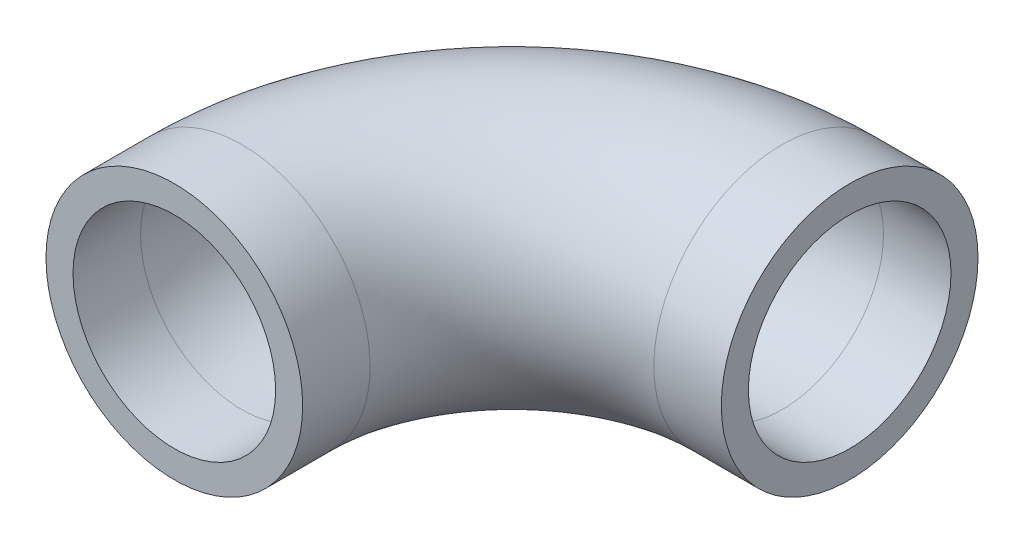
ISO-10303-21;
HEADER;
FILE_DESCRIPTION(('STEP AP214'),'2;1');
FILE_NAME('part.step','',(''),(''),'','','');
FILE_SCHEMA(('AUTOMOTIVE_DESIGN { 1 0 10303 214 1 1 1 1 }'));
ENDSEC;
DATA;
#1=APPLICATION_CONTEXT('core data for automotive mechanical design processes');
#2=APPLICATION_PROTOCOL_DEFINITION('international standard','automotive_design',2000,#1);
#3=PRODUCT_CONTEXT('',#1,'mechanical');
#4=PRODUCT('Part','Part','',(#3));
#5=PRODUCT_RELATED_PRODUCT_CATEGORY('part','',(#4));
#6=PRODUCT_DEFINITION_FORMATION('','',#4);
#7=PRODUCT_DEFINITION_CONTEXT('part definition',#1,'design');
#8=PRODUCT_DEFINITION('design','',#6,#7);
#9=PRODUCT_DEFINITION_SHAPE('','',#8);
#10=(LENGTH_UNIT() NAMED_UNIT(*) SI_UNIT(.MILLI.,.METRE.));
#11=(NAMED_UNIT(*) PLANE_ANGLE_UNIT() SI_UNIT($,.RADIAN.));
#12=(NAMED_UNIT(*) SI_UNIT($,.STERADIAN.) SOLID_ANGLE_UNIT());
#13=UNCERTAINTY_MEASURE_WITH_UNIT(LENGTH_MEASURE(1.E-05),#10,'distance_accuracy_value','');
#14=(GEOMETRIC_REPRESENTATION_CONTEXT(3) GLOBAL_UNCERTAINTY_ASSIGNED_CONTEXT((#13)) GLOBAL_UNIT_ASSIGNED_CONTEXT((#10,
#11,#12)) REPRESENTATION_CONTEXT('',''));
#15=CARTESIAN_POINT('',(0.,0.,0.));
#16=DIRECTION('',(0.,0.,1.));
#17=DIRECTION('',(1.,0.,0.));
#18=AXIS2_PLACEMENT_3D('',#15,#16,#17);
#19=CARTESIAN_POINT('',(0.,0.,0.));
#20=DIRECTION('',(0.,0.,-1.));
#21=DIRECTION('',(-1.,0.,0.));
#22=AXIS2_PLACEMENT_3D('',#19,#20,#21);
#23=CYLINDRICAL_SURFACE('',#22,24.13);
#24=CARTESIAN_POINT('',(0.,0.,-12.7));
#25=DIRECTION('',(0.,0.,1.));
#26=DIRECTION('',(1.,0.,0.));
#27=AXIS2_PLACEMENT_3D('',#24,#25,#26);
#28=CIRCLE('',#27,24.13);
#29=CARTESIAN_POINT('',(-24.13,0.,-12.7));
#30=VERTEX_POINT('',#29);
#31=EDGE_CURVE('E101',#30,#30,#28,.T.);
#32=ORIENTED_EDGE('',*,*,#31,.T.);
#33=EDGE_LOOP('',(#32));
#34=FACE_BOUND('',#33,.T.);
#35=CARTESIAN_POINT('',(0.,0.,0.));
#36=DIRECTION('',(0.,0.,1.));
#37=DIRECTION('',(1.,0.,0.));
#38=AXIS2_PLACEMENT_3D('',#35,#36,#37);
#39=CIRCLE('',#38,24.13);
#40=CARTESIAN_POINT('',(24.13,0.,0.));
#41=VERTEX_POINT('',#40);
#42=EDGE_CURVE('E50',#41,#41,#39,.T.);
#43=ORIENTED_EDGE('',*,*,#42,.F.);
#44=EDGE_LOOP('',(#43));
#45=FACE_BOUND('',#44,.T.);
#46=ADVANCED_FACE('F35',(#34,#45),#23,.T.);
#47=CARTESIAN_POINT('',(50.8,0.,-12.7));
#48=DIRECTION('',(0.,-1.,0.));
#49=DIRECTION('',(0.,0.,-1.));
#50=AXIS2_PLACEMENT_3D('',#47,#48,#49);
#51=TOROIDAL_SURFACE('',#50,50.8,24.13);
#52=CARTESIAN_POINT('',(50.8,0.,-63.5));
#53=DIRECTION('',(-1.,0.,0.));
#54=DIRECTION('',(0.,0.,1.));
#55=AXIS2_PLACEMENT_3D('',#52,#53,#54);
#56=CIRCLE('',#55,24.13);
#57=CARTESIAN_POINT('',(50.8,0.,-87.63));
#58=VERTEX_POINT('',#57);
#59=EDGE_CURVE('E39',#58,#58,#56,.T.);
#60=CARTESIAN_POINT('',(50.8,0.,-12.7));
#61=DIRECTION('',(0.,-1.,0.));
#62=DIRECTION('',(0.,0.,-1.));
#63=AXIS2_PLACEMENT_3D('',#60,#61,#62);
#64=CIRCLE('',#63,74.93);
#65=EDGE_CURVE('',#30,#58,#64,.T.);
#66=ORIENTED_EDGE('',*,*,#31,.F.);
#67=ORIENTED_EDGE('',*,*,#59,.T.);
#68=ORIENTED_EDGE('',*,*,#65,.T.);
#69=ORIENTED_EDGE('',*,*,#65,.F.);
#70=EDGE_LOOP('',(#66,#68,#67,#69));
#71=FACE_BOUND('',#70,.T.);
#72=ADVANCED_FACE('F108',(#71),#51,.T.);
#73=CARTESIAN_POINT('',(50.8,0.,-63.5));
#74=DIRECTION('',(1.,0.,0.));
#75=DIRECTION('',(0.,0.,-1.));
#76=AXIS2_PLACEMENT_3D('',#73,#74,#75);
#77=CYLINDRICAL_SURFACE('',#76,24.13);
#78=CARTESIAN_POINT('',(63.5,0.,-63.5));
#79=DIRECTION('',(-1.,0.,0.));
#80=DIRECTION('',(0.,0.,1.));
#81=AXIS2_PLACEMENT_3D('',#78,#79,#80);
#82=CIRCLE('',#81,24.13);
#83=CARTESIAN_POINT('',(63.5,0.,-39.37));
#84=VERTEX_POINT('',#83);
#85=EDGE_CURVE('E55',#84,#84,#82,.T.);
#86=ORIENTED_EDGE('',*,*,#85,.T.);
#87=EDGE_LOOP('',(#86));
#88=FACE_BOUND('',#87,.T.);
#89=ORIENTED_EDGE('',*,*,#59,.F.);
#90=EDGE_LOOP('',(#89));
#91=FACE_BOUND('',#90,.T.);
#92=ADVANCED_FACE('F37',(#88,#91),#77,.T.);
#93=CARTESIAN_POINT('',(0.,0.,0.));
#94=DIRECTION('',(0.,0.,1.));
#95=DIRECTION('',(1.,0.,0.));
#96=AXIS2_PLACEMENT_3D('',#93,#94,#95);
#97=PLANE('',#96);
#98=CARTESIAN_POINT('',(0.,0.,0.));
#99=DIRECTION('',(0.,0.,1.));
#100=DIRECTION('',(1.,0.,0.));
#101=AXIS2_PLACEMENT_3D('',#98,#99,#100);
#102=CIRCLE('',#101,19.05);
#103=CARTESIAN_POINT('',(19.05,0.,0.));
#104=VERTEX_POINT('',#103);
#105=EDGE_CURVE('E94',#104,#104,#102,.F.);
#106=ORIENTED_EDGE('',*,*,#105,.T.);
#107=EDGE_LOOP('',(#106));
#108=FACE_BOUND('',#107,.T.);
#109=ORIENTED_EDGE('',*,*,#42,.T.);
#110=EDGE_LOOP('',(#109));
#111=FACE_BOUND('',#110,.T.);
#112=ADVANCED_FACE('F68',(#108,#111),#97,.T.);
#113=CARTESIAN_POINT('',(63.5,0.,-63.5));
#114=DIRECTION('',(-1.,0.,0.));
#115=DIRECTION('',(0.,0.,1.));
#116=AXIS2_PLACEMENT_3D('',#113,#114,#115);
#117=PLANE('',#116);
#118=CARTESIAN_POINT('',(63.5,0.,-63.5));
#119=DIRECTION('',(-1.,0.,0.));
#120=DIRECTION('',(0.,0.,1.));
#121=AXIS2_PLACEMENT_3D('',#118,#119,#120);
#122=CIRCLE('',#121,19.05);
#123=CARTESIAN_POINT('',(63.5,0.,-44.45));
#124=VERTEX_POINT('',#123);
#125=EDGE_CURVE('E11',#124,#124,#122,.F.);
#126=ORIENTED_EDGE('',*,*,#125,.F.);
#127=EDGE_LOOP('',(#126));
#128=FACE_BOUND('',#127,.T.);
#129=ORIENTED_EDGE('',*,*,#85,.F.);
#130=EDGE_LOOP('',(#129));
#131=FACE_BOUND('',#130,.T.);
#132=ADVANCED_FACE('F65',(#128,#131),#117,.F.);
#133=CARTESIAN_POINT('',(0.,0.,0.));
#134=DIRECTION('',(0.,0.,-1.));
#135=DIRECTION('',(-1.,0.,0.));
#136=AXIS2_PLACEMENT_3D('',#133,#134,#135);
#137=CYLINDRICAL_SURFACE('',#136,19.05);
#138=CARTESIAN_POINT('',(0.,0.,-12.7));
#139=DIRECTION('',(0.,0.,1.));
#140=DIRECTION('',(1.,0.,0.));
#141=AXIS2_PLACEMENT_3D('',#138,#139,#140);
#142=CIRCLE('',#141,19.05);
#143=CARTESIAN_POINT('',(-19.05,0.,-12.7));
#144=VERTEX_POINT('',#143);
#145=EDGE_CURVE('E93',#144,#144,#142,.F.);
#146=ORIENTED_EDGE('',*,*,#145,.T.);
#147=EDGE_LOOP('',(#146));
#148=FACE_BOUND('',#147,.T.);
#149=ORIENTED_EDGE('',*,*,#105,.F.);
#150=EDGE_LOOP('',(#149));
#151=FACE_BOUND('',#150,.T.);
#152=ADVANCED_FACE('F67',(#148,#151),#137,.F.);
#153=CARTESIAN_POINT('',(50.8,0.,-12.7));
#154=DIRECTION('',(0.,-1.,0.));
#155=DIRECTION('',(0.,0.,-1.));
#156=AXIS2_PLACEMENT_3D('',#153,#154,#155);
#157=TOROIDAL_SURFACE('',#156,50.8,19.05);
#158=CARTESIAN_POINT('',(50.8,0.,-63.5));
#159=DIRECTION('',(-1.,0.,0.));
#160=DIRECTION('',(0.,0.,1.));
#161=AXIS2_PLACEMENT_3D('',#158,#159,#160);
#162=CIRCLE('',#161,19.05);
#163=CARTESIAN_POINT('',(50.8,0.,-82.55));
#164=VERTEX_POINT('',#163);
#165=EDGE_CURVE('E44',#164,#164,#162,.F.);
#166=CARTESIAN_POINT('',(50.8,0.,-12.7));
#167=DIRECTION('',(0.,-1.,0.));
#168=DIRECTION('',(0.,0.,-1.));
#169=AXIS2_PLACEMENT_3D('',#166,#167,#168);
#170=CIRCLE('',#169,69.85);
#171=EDGE_CURVE('',#144,#164,#170,.T.);
#172=ORIENTED_EDGE('',*,*,#145,.F.);
#173=ORIENTED_EDGE('',*,*,#165,.T.);
#174=ORIENTED_EDGE('',*,*,#171,.T.);
#175=ORIENTED_EDGE('',*,*,#171,.F.);
#176=EDGE_LOOP('',(#172,#174,#173,#175));
#177=FACE_BOUND('',#176,.T.);
#178=ADVANCED_FACE('F74',(#177),#157,.F.);
#179=CARTESIAN_POINT('',(50.8,0.,-63.5));
#180=DIRECTION('',(1.,0.,0.));
#181=DIRECTION('',(0.,0.,-1.));
#182=AXIS2_PLACEMENT_3D('',#179,#180,#181);
#183=CYLINDRICAL_SURFACE('',#182,19.05);
#184=ORIENTED_EDGE('',*,*,#125,.T.);
#185=EDGE_LOOP('',(#184));
#186=FACE_BOUND('',#185,.T.);
#187=ORIENTED_EDGE('',*,*,#165,.F.);
#188=EDGE_LOOP('',(#187));
#189=FACE_BOUND('',#188,.T.);
#190=ADVANCED_FACE('F62',(#186,#189),#183,.F.);
#191=CLOSED_SHELL('',(#46,#72,#92,#112,#132,#152,#178,#190));
#192=MANIFOLD_SOLID_BREP('B2',#191);
#193=ADVANCED_BREP_SHAPE_REPRESENTATION('',(#18,#192),#14);
#194=SHAPE_DEFINITION_REPRESENTATION(#9,#193);
ENDSEC;
END-ISO-10303-21;
